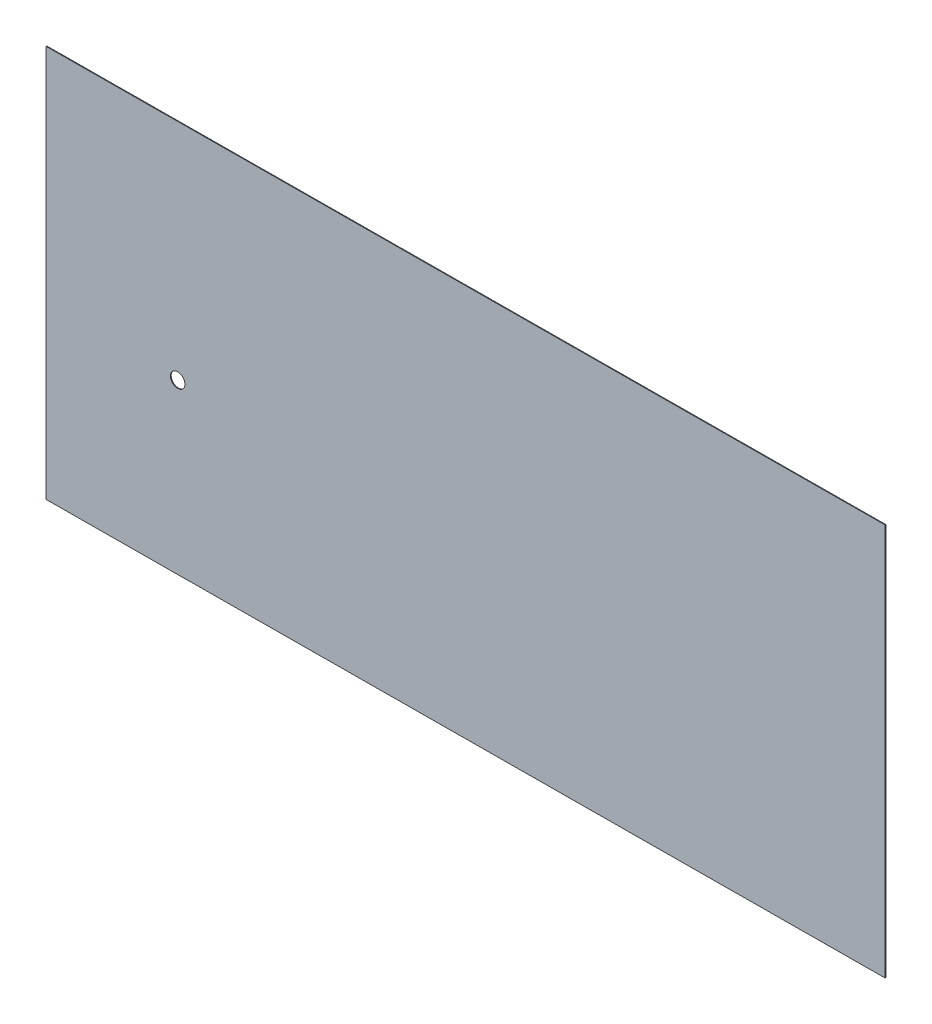
ISO-10303-21;
HEADER;
FILE_DESCRIPTION(('STEP AP214'),'2;1');
FILE_NAME('part.step','',(''),(''),'','','');
FILE_SCHEMA(('AUTOMOTIVE_DESIGN { 1 0 10303 214 1 1 1 1 }'));
ENDSEC;
DATA;
#1=APPLICATION_CONTEXT('core data for automotive mechanical design processes');
#2=APPLICATION_PROTOCOL_DEFINITION('international standard','automotive_design',2000,#1);
#3=PRODUCT_CONTEXT('',#1,'mechanical');
#4=PRODUCT('Part','Part','',(#3));
#5=PRODUCT_RELATED_PRODUCT_CATEGORY('part','',(#4));
#6=PRODUCT_DEFINITION_FORMATION('','',#4);
#7=PRODUCT_DEFINITION_CONTEXT('part definition',#1,'design');
#8=PRODUCT_DEFINITION('design','',#6,#7);
#9=PRODUCT_DEFINITION_SHAPE('','',#8);
#10=(LENGTH_UNIT() NAMED_UNIT(*) SI_UNIT(.MILLI.,.METRE.));
#11=(NAMED_UNIT(*) PLANE_ANGLE_UNIT() SI_UNIT($,.RADIAN.));
#12=(NAMED_UNIT(*) SI_UNIT($,.STERADIAN.) SOLID_ANGLE_UNIT());
#13=UNCERTAINTY_MEASURE_WITH_UNIT(LENGTH_MEASURE(1.E-05),#10,'distance_accuracy_value','');
#14=(GEOMETRIC_REPRESENTATION_CONTEXT(3) GLOBAL_UNCERTAINTY_ASSIGNED_CONTEXT((#13)) GLOBAL_UNIT_ASSIGNED_CONTEXT((#10,
#11,#12)) REPRESENTATION_CONTEXT('',''));
#15=CARTESIAN_POINT('',(0.,0.,0.));
#16=DIRECTION('',(0.,0.,1.));
#17=DIRECTION('',(1.,0.,0.));
#18=AXIS2_PLACEMENT_3D('',#15,#16,#17);
#19=CARTESIAN_POINT('',(-4.99393203883525,546.5,-822.984848367691));
#20=DIRECTION('',(0.999981589754181,0.,-0.00606796116504866));
#21=DIRECTION('',(0.,1.,0.));
#22=AXIS2_PLACEMENT_3D('',#19,#20,#21);
#23=PLANE('',#22);
#24=DIRECTION('',(0.00606796116504867,0.,0.999981589754181));
#25=VECTOR('',#24,1.);
#26=CARTESIAN_POINT('',(-4.99393203883525,1093.,-822.984848367691));
#27=LINE('',#26,#25);
#28=CARTESIAN_POINT('',(-5.000000000001,1093.,-823.984829957446));
#29=VERTEX_POINT('',#28);
#30=CARTESIAN_POINT('',(-4.9878640776706,1093.,-821.984866777937));
#31=VERTEX_POINT('',#30);
#32=EDGE_CURVE('E11',#29,#31,#27,.T.);
#33=ORIENTED_EDGE('',*,*,#32,.F.);
#34=DIRECTION('',(0.,1.,0.));
#35=VECTOR('',#34,1.);
#36=CARTESIAN_POINT('',(-5.000000000001,546.5,-823.984829957446));
#37=LINE('',#36,#35);
#38=CARTESIAN_POINT('',(-5.000000000001,0.,-823.984829957446));
#39=VERTEX_POINT('',#38);
#40=EDGE_CURVE('E79',#29,#39,#37,.F.);
#41=ORIENTED_EDGE('',*,*,#40,.T.);
#42=DIRECTION('',(0.00606796116504867,0.,0.999981589754181));
#43=VECTOR('',#42,1.);
#44=CARTESIAN_POINT('',(-4.99393203883525,0.,-822.984848367691));
#45=LINE('',#44,#43);
#46=CARTESIAN_POINT('',(-4.9878640776706,0.,-821.984866777937));
#47=VERTEX_POINT('',#46);
#48=EDGE_CURVE('E51',#39,#47,#45,.T.);
#49=ORIENTED_EDGE('',*,*,#48,.T.);
#50=DIRECTION('',(0.,1.,0.));
#51=VECTOR('',#50,1.);
#52=CARTESIAN_POINT('',(-4.9878640776706,546.5,-821.984866777937));
#53=LINE('',#52,#51);
#54=EDGE_CURVE('E81',#31,#47,#53,.F.);
#55=ORIENTED_EDGE('',*,*,#54,.F.);
#56=EDGE_LOOP('',(#33,#41,#49,#55));
#57=FACE_BOUND('',#56,.T.);
#58=ADVANCED_FACE('F40',(#57),#23,.F.);
#59=CARTESIAN_POINT('',(1156.30423815181,0.,-830.031690299543));
#60=DIRECTION('',(0.,-1.,0.));
#61=DIRECTION('',(0.999981589754181,0.,-0.00606796116504866));
#62=AXIS2_PLACEMENT_3D('',#59,#60,#61);
#63=PLANE('',#62);
#64=ORIENTED_EDGE('',*,*,#48,.F.);
#65=DIRECTION('',(0.999981589754181,0.,-0.00606796116504866));
#66=VECTOR('',#65,1.);
#67=CARTESIAN_POINT('',(1156.29817019064,0.,-831.031671889297));
#68=LINE('',#67,#66);
#69=CARTESIAN_POINT('',(2317.59634038129,0.,-838.078513821148));
#70=VERTEX_POINT('',#69);
#71=EDGE_CURVE('E93',#39,#70,#68,.T.);
#72=ORIENTED_EDGE('',*,*,#71,.T.);
#73=DIRECTION('',(0.00606796116504867,0.,0.999981589754181));
#74=VECTOR('',#73,1.);
#75=CARTESIAN_POINT('',(2317.60240834245,0.,-837.078532231394));
#76=LINE('',#75,#74);
#77=CARTESIAN_POINT('',(2317.60847630362,0.,-836.078550641639));
#78=VERTEX_POINT('',#77);
#79=EDGE_CURVE('E108',#70,#78,#76,.T.);
#80=ORIENTED_EDGE('',*,*,#79,.T.);
#81=DIRECTION('',(0.999981589754181,0.,-0.00606796116504866));
#82=VECTOR('',#81,1.);
#83=CARTESIAN_POINT('',(1156.31030611297,0.,-829.031708709788));
#84=LINE('',#83,#82);
#85=EDGE_CURVE('E102',#47,#78,#84,.T.);
#86=ORIENTED_EDGE('',*,*,#85,.F.);
#87=EDGE_LOOP('',(#64,#72,#80,#86));
#88=FACE_BOUND('',#87,.T.);
#89=ADVANCED_FACE('F120',(#88),#63,.T.);
#90=CARTESIAN_POINT('',(2317.60240834245,546.5,-837.078532231394));
#91=DIRECTION('',(0.999981589754181,0.,-0.00606796116504866));
#92=DIRECTION('',(0.,1.,0.));
#93=AXIS2_PLACEMENT_3D('',#90,#91,#92);
#94=PLANE('',#93);
#95=ORIENTED_EDGE('',*,*,#79,.F.);
#96=DIRECTION('',(0.,1.,0.));
#97=VECTOR('',#96,1.);
#98=CARTESIAN_POINT('',(2317.59634038129,546.5,-838.078513821148));
#99=LINE('',#98,#97);
#100=CARTESIAN_POINT('',(2317.59634038129,1093.,-838.078513821148));
#101=VERTEX_POINT('',#100);
#102=EDGE_CURVE('E98',#70,#101,#99,.T.);
#103=ORIENTED_EDGE('',*,*,#102,.T.);
#104=DIRECTION('',(0.00606796116504867,0.,0.999981589754181));
#105=VECTOR('',#104,1.);
#106=CARTESIAN_POINT('',(2317.60240834245,1093.,-837.078532231394));
#107=LINE('',#106,#105);
#108=CARTESIAN_POINT('',(2317.60847630362,1093.,-836.078550641639));
#109=VERTEX_POINT('',#108);
#110=EDGE_CURVE('E44',#101,#109,#107,.T.);
#111=ORIENTED_EDGE('',*,*,#110,.T.);
#112=DIRECTION('',(0.,1.,0.));
#113=VECTOR('',#112,1.);
#114=CARTESIAN_POINT('',(2317.60847630362,546.5,-836.078550641639));
#115=LINE('',#114,#113);
#116=EDGE_CURVE('E121',#78,#109,#115,.T.);
#117=ORIENTED_EDGE('',*,*,#116,.F.);
#118=EDGE_LOOP('',(#95,#103,#111,#117));
#119=FACE_BOUND('',#118,.T.);
#120=ADVANCED_FACE('F176',(#119),#94,.T.);
#121=CARTESIAN_POINT('',(1156.30423815181,1093.,-830.031690299543));
#122=DIRECTION('',(0.,-1.,0.));
#123=DIRECTION('',(0.999981589754181,0.,-0.00606796116504866));
#124=AXIS2_PLACEMENT_3D('',#121,#122,#123);
#125=PLANE('',#124);
#126=DIRECTION('',(0.999981589754181,0.,-0.00606796116504866));
#127=VECTOR('',#126,1.);
#128=CARTESIAN_POINT('',(1156.29817019064,1093.,-831.031671889297));
#129=LINE('',#128,#127);
#130=EDGE_CURVE('E91',#101,#29,#129,.F.);
#131=ORIENTED_EDGE('',*,*,#130,.T.);
#132=ORIENTED_EDGE('',*,*,#32,.T.);
#133=DIRECTION('',(0.999981589754181,0.,-0.00606796116504866));
#134=VECTOR('',#133,1.);
#135=CARTESIAN_POINT('',(1156.31030611297,1093.,-829.031708709788));
#136=LINE('',#135,#134);
#137=EDGE_CURVE('E119',#109,#31,#136,.F.);
#138=ORIENTED_EDGE('',*,*,#137,.F.);
#139=ORIENTED_EDGE('',*,*,#110,.F.);
#140=EDGE_LOOP('',(#131,#132,#138,#139));
#141=FACE_BOUND('',#140,.T.);
#142=ADVANCED_FACE('F42',(#141),#125,.F.);
#143=CARTESIAN_POINT('',(1156.31030611297,546.5,-829.031708709788));
#144=DIRECTION('',(0.00606796116504867,0.,0.999981589754181));
#145=DIRECTION('',(0.999981589754181,0.,-0.00606796116504866));
#146=AXIS2_PLACEMENT_3D('',#143,#144,#145);
#147=PLANE('',#146);
#148=CARTESIAN_POINT('',(339.074950675495,469.0000000268,-824.072665013075));
#149=CARTESIAN_POINT('',(339.074952175354,468.328584783968,-824.072665022177));
#150=CARTESIAN_POINT('',(339.109270419941,467.657108868376,-824.072873267786));
#151=CARTESIAN_POINT('',(339.245169879086,466.321042548984,-824.073697915608));
#152=CARTESIAN_POINT('',(339.346748960097,465.656451927458,-824.074314304875));
#153=CARTESIAN_POINT('',(339.593612302406,464.449151278049,-824.075812289628));
#154=CARTESIAN_POINT('',(339.728953983658,463.904381306161,-824.076633552813));
#155=CARTESIAN_POINT('',(340.044908442255,462.827879149409,-824.078550787494));
#156=CARTESIAN_POINT('',(340.225531299392,462.296149896439,-824.079646820155));
#157=CARTESIAN_POINT('',(340.529891044368,461.51132230611,-824.08149369727));
#158=CARTESIAN_POINT('',(340.637000907703,461.251665596134,-824.082143647727));
#159=CARTESIAN_POINT('',(340.86218373962,460.737150092206,-824.083510073562));
#160=CARTESIAN_POINT('',(340.980256731423,460.482291308418,-824.084226549081));
#161=CARTESIAN_POINT('',(341.350458081397,459.725569546191,-824.086472957853));
#162=CARTESIAN_POINT('',(341.618616336485,459.231438855324,-824.088100161688));
#163=CARTESIAN_POINT('',(342.195074381275,458.267799266706,-824.091598151116));
#164=CARTESIAN_POINT('',(342.503342534786,457.798271368953,-824.093468744738));
#165=CARTESIAN_POINT('',(343.158007303258,456.886586975724,-824.097441298265));
#166=CARTESIAN_POINT('',(343.504402925405,456.444429768001,-824.099543252146));
#167=CARTESIAN_POINT('',(344.23306707273,455.590874551994,-824.103964839296));
#168=CARTESIAN_POINT('',(344.615328194218,455.179470226782,-824.106284427641));
#169=CARTESIAN_POINT('',(345.413449958345,454.390659581939,-824.111127488672));
#170=CARTESIAN_POINT('',(345.829310711533,454.013253374179,-824.11365096203));
#171=CARTESIAN_POINT('',(346.692037001546,453.293955871417,-824.118886048034));
#172=CARTESIAN_POINT('',(347.138960933633,452.952134658138,-824.121598015025));
#173=CARTESIAN_POINT('',(348.059793722772,452.307013749988,-824.1271856955));
#174=CARTESIAN_POINT('',(348.533703530012,452.003715412744,-824.130061414749));
#175=CARTESIAN_POINT('',(349.505342994726,451.437768861924,-824.135957393833));
#176=CARTESIAN_POINT('',(350.003074469016,451.175123755352,-824.138977664694));
#177=CARTESIAN_POINT('',(350.764818901969,450.813411875849,-824.143599985429));
#178=CARTESIAN_POINT('',(351.021279558414,450.698209217535,-824.145156207383));
#179=CARTESIAN_POINT('',(351.538873406771,450.478828487614,-824.148297004577));
#180=CARTESIAN_POINT('',(351.800006590888,450.374650397616,-824.149881579769));
#181=CARTESIAN_POINT('',(352.590833119863,450.078427140048,-824.154680372782));
#182=CARTESIAN_POINT('',(353.126924769694,449.903181193952,-824.157933415984));
#183=CARTESIAN_POINT('',(354.21189057084,449.598290184663,-824.164517067537));
#184=CARTESIAN_POINT('',(354.760765850328,449.468649162546,-824.167847682735));
#185=CARTESIAN_POINT('',(355.867441774931,449.255716661479,-824.1745630729));
#186=CARTESIAN_POINT('',(356.425242535724,449.172425783747,-824.177947848568));
#187=CARTESIAN_POINT('',(357.54589935732,449.052978130169,-824.184748075835));
#188=CARTESIAN_POINT('',(358.108754956869,449.016817096848,-824.188163524634));
#189=CARTESIAN_POINT('',(358.954231121696,448.998541146611,-824.19329393562));
#190=CARTESIAN_POINT('',(359.236562343049,448.998462945255,-824.195007142048));
#191=CARTESIAN_POINT('',(359.800971447485,449.010350512539,-824.198432017627));
#192=CARTESIAN_POINT('',(360.083049329275,449.022316342317,-824.200143686772));
#193=CARTESIAN_POINT('',(360.928159622313,449.07611148578,-824.205271877622));
#194=CARTESIAN_POINT('',(361.490153407282,449.135836677355,-824.208682096867));
#195=CARTESIAN_POINT('',(362.60705317246,449.302214176087,-824.215459526041));
#196=CARTESIAN_POINT('',(363.161959347974,449.408865187283,-824.218826737155));
#197=CARTESIAN_POINT('',(364.260873553531,449.668306810475,-824.225495028644));
#198=CARTESIAN_POINT('',(364.804882142169,449.821095051048,-824.228796112407));
#199=CARTESIAN_POINT('',(365.877594682711,450.17193830677,-824.235305410282));
#200=CARTESIAN_POINT('',(366.406311487938,450.369953982559,-824.238513702389));
#201=CARTESIAN_POINT('',(367.444915217162,450.810400686034,-824.244816025511));
#202=CARTESIAN_POINT('',(367.954801897487,451.052832288242,-824.247910055047));
#203=CARTESIAN_POINT('',(368.952320239554,451.579740142177,-824.253963069046));
#204=CARTESIAN_POINT('',(369.439953009069,451.86421429808,-824.25692206023));
#205=CARTESIAN_POINT('',(370.389667241782,452.47301412735,-824.262684995409));
#206=CARTESIAN_POINT('',(370.851748060552,452.797340805143,-824.265488935494));
#207=CARTESIAN_POINT('',(371.746367629377,453.483156167313,-824.270917552237));
#208=CARTESIAN_POINT('',(372.178953299703,453.844583423546,-824.273542513611));
#209=CARTESIAN_POINT('',(372.803609770618,454.413112882475,-824.277332974601));
#210=CARTESIAN_POINT('',(373.007807454583,454.607037906361,-824.27857206103));
#211=CARTESIAN_POINT('',(373.407732098095,455.00343441923,-824.280998832913));
#212=CARTESIAN_POINT('',(373.603459064168,455.205905901629,-824.282186518407));
#213=CARTESIAN_POINT('',(374.177444300262,455.825479544813,-824.285669502652));
#214=CARTESIAN_POINT('',(374.542616220354,456.254840469881,-824.287885392477));
#215=CARTESIAN_POINT('',(375.235603274204,457.142682538101,-824.292090488424));
#216=CARTESIAN_POINT('',(375.563415260795,457.601166129461,-824.294079675449));
#217=CARTESIAN_POINT('',(376.178940525812,458.543145122823,-824.297814727617));
#218=CARTESIAN_POINT('',(376.466723787482,459.02659479323,-824.299561017423));
#219=CARTESIAN_POINT('',(377.000654100661,460.015999684072,-824.302800945476));
#220=CARTESIAN_POINT('',(377.246805072431,460.521952779822,-824.304294607512));
#221=CARTESIAN_POINT('',(377.583000145425,461.295099422616,-824.306334663716));
#222=CARTESIAN_POINT('',(377.689570187765,461.555214884852,-824.3069813385));
#223=CARTESIAN_POINT('',(377.891539954353,462.079747459035,-824.308206905763));
#224=CARTESIAN_POINT('',(377.98693961477,462.344164595553,-824.308785797856));
#225=CARTESIAN_POINT('',(378.25625194264,463.143126324075,-824.310420004688));
#226=CARTESIAN_POINT('',(378.413311055489,463.683457490496,-824.311373050831));
#227=CARTESIAN_POINT('',(378.681368127529,464.774449967184,-824.312999640681));
#228=CARTESIAN_POINT('',(378.792437652468,465.325093823066,-824.313673618653));
#229=CARTESIAN_POINT('',(378.968135056628,466.433734533422,-824.314739763306));
#230=CARTESIAN_POINT('',(379.032765560813,466.991730970475,-824.315131945916));
#231=CARTESIAN_POINT('',(379.114734102223,468.111222716915,-824.315629336999));
#232=CARTESIAN_POINT('',(379.132070318143,468.672718160215,-824.315734534421));
#233=CARTESIAN_POINT('',(379.118809720978,469.795148377628,-824.31565406815));
#234=CARTESIAN_POINT('',(379.088212075773,470.356083141839,-824.315468399409));
#235=CARTESIAN_POINT('',(378.980024848169,471.473159084359,-824.314811911427));
#236=CARTESIAN_POINT('',(378.902454287958,472.02930211072,-824.314341207615));
#237=CARTESIAN_POINT('',(378.70111444451,473.133154837478,-824.313119462771));
#238=CARTESIAN_POINT('',(378.577344069219,473.680864338209,-824.312368415114));
#239=CARTESIAN_POINT('',(378.284339120088,474.764093713258,-824.310590439728));
#240=CARTESIAN_POINT('',(378.115102697336,475.299613090895,-824.309563500781));
#241=CARTESIAN_POINT('',(377.82781033987,476.090586390828,-824.307820189818));
#242=CARTESIAN_POINT('',(377.726463403566,476.352214537696,-824.307205209223));
#243=CARTESIAN_POINT('',(377.512706199904,476.870911505566,-824.305908114932));
#244=CARTESIAN_POINT('',(377.400295936653,477.12798032826,-824.305226001262));
#245=CARTESIAN_POINT('',(377.046565834361,477.89237554854,-824.303079541222));
#246=CARTESIAN_POINT('',(376.788969423898,478.392278150117,-824.30151642743));
#247=CARTESIAN_POINT('',(376.232794867,479.368703422376,-824.298141519685));
#248=CARTESIAN_POINT('',(375.934213216145,479.845224089063,-824.296329704467));
#249=CARTESIAN_POINT('',(375.298271341336,480.771656922457,-824.292470762823));
#250=CARTESIAN_POINT('',(374.960910467409,481.221568642984,-824.290423632453));
#251=CARTESIAN_POINT('',(374.249596612627,482.091512049361,-824.286107328142));
#252=CARTESIAN_POINT('',(373.875646950778,482.511546439456,-824.283838174341));
#253=CARTESIAN_POINT('',(373.288560056597,483.11705250429,-824.28027568828));
#254=CARTESIAN_POINT('',(373.088205942675,483.315056143921,-824.279059924915));
#255=CARTESIAN_POINT('',(372.679248696577,483.702352719295,-824.276578342541));
#256=CARTESIAN_POINT('',(372.470645513868,483.891645601659,-824.275312523225));
#257=CARTESIAN_POINT('',(371.833097763102,484.446056389193,-824.271443837009));
#258=CARTESIAN_POINT('',(371.392357640631,484.797765506333,-824.268769393825));
#259=CARTESIAN_POINT('',(370.483057289835,485.462965174763,-824.263251693027));
#260=CARTESIAN_POINT('',(370.014497566065,485.776456418881,-824.260408438474));
#261=CARTESIAN_POINT('',(369.052715495149,486.363137401864,-824.254572274774));
#262=CARTESIAN_POINT('',(368.559494522956,486.636329384209,-824.251579373969));
#263=CARTESIAN_POINT('',(367.803712365125,487.014210949669,-824.246993232754));
#264=CARTESIAN_POINT('',(367.549031736174,487.134891523151,-824.245447812136));
#265=CARTESIAN_POINT('',(367.034769095232,487.365313273446,-824.242327228951));
#266=CARTESIAN_POINT('',(366.77518711266,487.47505451589,-824.240752066563));
#267=CARTESIAN_POINT('',(365.989786958281,487.787511641157,-824.235986201186));
#268=CARTESIAN_POINT('',(365.457211859471,487.973512303251,-824.232754496673));
#269=CARTESIAN_POINT('',(364.37841883179,488.300056202502,-824.226208301959));
#270=CARTESIAN_POINT('',(363.83220155359,488.440601603224,-824.222893815706));
#271=CARTESIAN_POINT('',(362.729916581183,488.675521207358,-824.21620507016));
#272=CARTESIAN_POINT('',(362.173848689398,488.769894483583,-824.212830809666));
#273=CARTESIAN_POINT('',(361.055857900588,488.911663771668,-824.206046760081));
#274=CARTESIAN_POINT('',(360.493936918798,488.959074690932,-824.202636982611));
#275=CARTESIAN_POINT('',(359.649707434912,488.99439437731,-824.197514136575));
#276=CARTESIAN_POINT('',(359.368048937001,489.000200462188,-824.195805012283));
#277=CARTESIAN_POINT('',(358.804740816556,488.999788934876,-824.192386817554));
#278=CARTESIAN_POINT('',(358.523091194024,488.993571320737,-824.190677747118));
#279=CARTESIAN_POINT('',(357.678961839336,488.95702484658,-824.185555508674));
#280=CARTESIAN_POINT('',(357.117157180109,488.908808330006,-824.182146437057));
#281=CARTESIAN_POINT('',(355.999601031846,488.765468324197,-824.175365024902));
#282=CARTESIAN_POINT('',(355.443850039914,488.670341012053,-824.17199268738));
#283=CARTESIAN_POINT('',(354.342483501728,488.433997701838,-824.165309514959));
#284=CARTESIAN_POINT('',(353.796863404374,488.292802955359,-824.161998652444));
#285=CARTESIAN_POINT('',(352.719444192978,487.965103035531,-824.155460794147));
#286=CARTESIAN_POINT('',(352.187643810326,487.77860203755,-824.152233790668));
#287=CARTESIAN_POINT('',(351.141853696899,487.360966134576,-824.145887860042));
#288=CARTESIAN_POINT('',(350.627864217071,487.129830601006,-824.142768934419));
#289=CARTESIAN_POINT('',(349.621177617009,486.625021319542,-824.136660286763));
#290=CARTESIAN_POINT('',(349.128482290741,486.351343996527,-824.133670575616));
#291=CARTESIAN_POINT('',(348.167979228309,485.76388990398,-824.127842173032));
#292=CARTESIAN_POINT('',(347.700158982433,485.4501335656,-824.125003405685));
#293=CARTESIAN_POINT('',(346.792389726971,484.784529605132,-824.119494995685));
#294=CARTESIAN_POINT('',(346.352439020317,484.432684305949,-824.116825342733));
#295=CARTESIAN_POINT('',(345.716045241389,483.878128476373,-824.112963658903));
#296=CARTESIAN_POINT('',(345.507816558485,483.688791794085,-824.111700112079));
#297=CARTESIAN_POINT('',(345.099604715721,483.301429321405,-824.109223052867));
#298=CARTESIAN_POINT('',(344.899621511144,483.103403578148,-824.108009540207));
#299=CARTESIAN_POINT('',(344.312615221318,482.496816821291,-824.104447543259));
#300=CARTESIAN_POINT('',(343.938451109496,482.075672792408,-824.10217708816));
#301=CARTESIAN_POINT('',(343.227176974005,481.203834421196,-824.097861024868));
#302=CARTESIAN_POINT('',(342.890037958911,480.753163646851,-824.095815240754));
#303=CARTESIAN_POINT('',(342.254626174613,479.825198867051,-824.091959515738));
#304=CARTESIAN_POINT('',(341.956353917889,479.347904510669,-824.090149577946));
#305=CARTESIAN_POINT('',(341.400761819851,478.369692677941,-824.086778204604));
#306=CARTESIAN_POINT('',(341.143459195437,477.868765384219,-824.085216873527));
#307=CARTESIAN_POINT('',(340.790131946014,477.102492350908,-824.083072858027));
#308=CARTESIAN_POINT('',(340.677785559052,476.844564393553,-824.082391131963));
#309=CARTESIAN_POINT('',(340.464222065708,476.324140835307,-824.081095213121));
#310=CARTESIAN_POINT('',(340.363005029024,476.061645205822,-824.080481020765));
#311=CARTESIAN_POINT('',(340.070864330367,475.253304268342,-824.078708289715));
#312=CARTESIAN_POINT('',(339.898011162659,474.700806956101,-824.077659404096));
#313=CARTESIAN_POINT('',(339.600619008273,473.582950371683,-824.07585480683));
#314=CARTESIAN_POINT('',(339.476088501504,473.017588860443,-824.075099146639));
#315=CARTESIAN_POINT('',(339.276312491995,471.878922220276,-824.073886891253));
#316=CARTESIAN_POINT('',(339.201005616047,471.305627896899,-824.073429923642));
#317=CARTESIAN_POINT('',(339.100333750341,470.154902890722,-824.072819039424));
#318=CARTESIAN_POINT('',(339.07494938549,469.577473899959,-824.072665005248));
#319=CARTESIAN_POINT('',(339.074950675495,469.0000000268,-824.072665013075));
#320=B_SPLINE_CURVE_WITH_KNOTS('',3,(#148,#149,#150,#151,#152,#153,#154,#155,#156,#157,#158,
#159,#160,#161,#162,#163,#164,#165,#166,#167,#168,#169,#170,#171,#172,#173,#174,#175,#176,#177,
#178,#179,#180,#181,#182,#183,#184,#185,#186,#187,#188,#189,#190,#191,#192,#193,#194,#195,#196,
#197,#198,#199,#200,#201,#202,#203,#204,#205,#206,#207,#208,#209,#210,#211,#212,#213,#214,#215,
#216,#217,#218,#219,#220,#221,#222,#223,#224,#225,#226,#227,#228,#229,#230,#231,#232,#233,#234,
#235,#236,#237,#238,#239,#240,#241,#242,#243,#244,#245,#246,#247,#248,#249,#250,#251,#252,#253,
#254,#255,#256,#257,#258,#259,#260,#261,#262,#263,#264,#265,#266,#267,#268,#269,#270,#271,#272,
#273,#274,#275,#276,#277,#278,#279,#280,#281,#282,#283,#284,#285,#286,#287,#288,#289,#290,#291,
#292,#293,#294,#295,#296,#297,#298,#299,#300,#301,#302,#303,#304,#305,#306,#307,#308,#309,#310,
#311,#312,#313,#314,#315,#316,#317,#318,#319),.UNSPECIFIED.,.T.,.F.,(4,2,2,2,2,2,2,2,2,2,2,2,2,
2,2,2,2,2,2,2,2,2,2,2,2,2,2,2,2,2,2,2,2,2,2,2,2,2,2,2,2,2,2,2,2,2,2,2,2,2,2,2,2,2,2,2,2,2,2,2,2,
2,2,2,2,2,2,2,2,2,2,2,2,2,2,2,2,2,2,2,2,2,2,2,2,4),(0.,2.01353392695023,4.02700398669606,
5.70914538217014,7.39166156289532,8.23408621213205,9.07651264581496,10.760973159179,
12.4441130387638,14.12720910087,15.8099584838925,17.4927134037393,19.1787220547761,
20.8647901078503,22.5509869584557,23.3942214977713,24.2374546303952,25.9273256999312,
27.6173464720607,29.3073891653202,30.9972791779925,31.8440640693849,32.6908532593373,
34.3841782275761,36.0774564338275,37.7706476215787,39.4623716226229,41.1541175077314,
42.8457790876292,44.5374833122072,46.2264303966459,47.0710434810042,47.9156559147642,
49.6044386485476,51.2933635388285,52.9792974908214,54.665072600086,55.5081520887305,
56.3512363947963,58.0371564276551,59.7204430006888,61.4036344185279,63.0868906552236,
64.7701761131278,66.4527803618988,68.1354243859701,69.8181368464537,70.659633679672,
71.5011302004871,73.1860722213508,74.8711584020827,76.5562728303415,78.2412345416283,
79.0860777051074,79.9309260448619,81.6203765225386,83.3097963686769,84.9991221284454,
85.844395323791,86.6896634474991,88.3798562670362,90.0699686254502,91.7601149217992,
93.4497245378081,94.294673018027,95.1396216351712,96.8290865863068,98.5186892400169,
100.207513554385,101.896182287845,103.584874804141,105.273709311314,106.961686308532,
108.649560420214,109.493664803831,110.33776460901,112.025629706165,113.712163602028,
115.398719733541,117.085982756098,117.929762222285,118.773546972376,120.507891631564,
122.242540504946,123.975022429757,125.706831839724),.UNSPECIFIED.);
#321=CARTESIAN_POINT('',(379.126827566034,469.,-824.315702721019));
#322=VERTEX_POINT('',#321);
#323=EDGE_CURVE('E95',#322,#322,#320,.F.);
#324=ORIENTED_EDGE('',*,*,#323,.T.);
#325=EDGE_LOOP('',(#324));
#326=FACE_BOUND('',#325,.T.);
#327=ORIENTED_EDGE('',*,*,#116,.T.);
#328=ORIENTED_EDGE('',*,*,#137,.T.);
#329=ORIENTED_EDGE('',*,*,#54,.T.);
#330=ORIENTED_EDGE('',*,*,#85,.T.);
#331=EDGE_LOOP('',(#327,#328,#329,#330));
#332=FACE_BOUND('',#331,.T.);
#333=ADVANCED_FACE('F118',(#326,#332),#147,.T.);
#334=CARTESIAN_POINT('',(1156.29817019064,546.5,-831.031671889297));
#335=DIRECTION('',(0.00606796116504867,0.,0.999981589754181));
#336=DIRECTION('',(0.999981589754181,0.,-0.00606796116504866));
#337=AXIS2_PLACEMENT_3D('',#334,#335,#336);
#338=PLANE('',#337);
#339=CARTESIAN_POINT('',(339.111430960637,469.000000024332,-826.072923199274));
#340=CARTESIAN_POINT('',(339.111432415972,469.671394371171,-826.072923208105));
#341=CARTESIAN_POINT('',(339.145653939678,470.342848187122,-826.073130866805));
#342=CARTESIAN_POINT('',(339.281199721399,471.678903886554,-826.073953368487));
#343=CARTESIAN_POINT('',(339.382521656179,472.343506006455,-826.074568197371));
#344=CARTESIAN_POINT('',(339.62899092243,473.551834998791,-826.076063790842));
#345=CARTESIAN_POINT('',(339.764294214453,474.097596151142,-826.076884821079));
#346=CARTESIAN_POINT('',(340.080255350267,475.176081349034,-826.078802096278));
#347=CARTESIAN_POINT('',(340.260923331118,475.708802451444,-826.079898402753));
#348=CARTESIAN_POINT('',(340.565421845941,476.495110421861,-826.081746121932));
#349=CARTESIAN_POINT('',(340.672590127967,476.755260208834,-826.082396426878));
#350=CARTESIAN_POINT('',(340.89791136495,477.270758639712,-826.083763692566));
#351=CARTESIAN_POINT('',(341.016064345023,477.526107272637,-826.08448065346));
#352=CARTESIAN_POINT('',(341.386543350173,478.284289838733,-826.086728747063));
#353=CARTESIAN_POINT('',(341.654936957909,478.779382910244,-826.088357379036));
#354=CARTESIAN_POINT('',(342.231946568775,479.744821204885,-826.091858715407));
#355=CARTESIAN_POINT('',(342.540524694286,480.215189154929,-826.093731189961));
#356=CARTESIAN_POINT('',(343.195942239001,481.128475078535,-826.097708311389));
#357=CARTESIAN_POINT('',(343.542780583001,481.571393822942,-826.099812951738));
#358=CARTESIAN_POINT('',(344.2724816247,482.426344493428,-826.10424083084));
#359=CARTESIAN_POINT('',(344.655336615651,482.838382993432,-826.106564022827));
#360=CARTESIAN_POINT('',(345.454786098481,483.62831366243,-826.111415140553));
#361=CARTESIAN_POINT('',(345.87138075344,484.006205666357,-826.11394306728));
#362=CARTESIAN_POINT('',(346.734767341825,484.725523599301,-826.119182160022));
#363=CARTESIAN_POINT('',(347.181552439548,485.066957738212,-826.121893284557));
#364=CARTESIAN_POINT('',(348.102118669631,485.711248501386,-826.127479347531));
#365=CARTESIAN_POINT('',(348.575900640201,486.014103926895,-826.130354291058));
#366=CARTESIAN_POINT('',(349.54730104495,486.57906909734,-826.136248819509));
#367=CARTESIAN_POINT('',(350.044921097085,486.841176071425,-826.139268414252));
#368=CARTESIAN_POINT('',(350.806512053352,487.201976669059,-826.143889803679));
#369=CARTESIAN_POINT('',(351.062924008856,487.316858258698,-826.145445730113));
#370=CARTESIAN_POINT('',(351.580422693765,487.535559309964,-826.148585949848));
#371=CARTESIAN_POINT('',(351.84150941579,487.639378789049,-826.150170243105));
#372=CARTESIAN_POINT('',(352.63094037469,487.934011773649,-826.154960567697));
#373=CARTESIAN_POINT('',(353.165637259132,488.108085903585,-826.15820514736));
#374=CARTESIAN_POINT('',(354.247731722868,488.410706683448,-826.164771375429));
#375=CARTESIAN_POINT('',(354.795130410664,488.539249343751,-826.168093030561));
#376=CARTESIAN_POINT('',(355.898772743475,488.750044542416,-826.17479001267));
#377=CARTESIAN_POINT('',(356.455016439535,488.832296813538,-826.178165339956));
#378=CARTESIAN_POINT('',(357.572482726411,488.949711572872,-826.184946206826));
#379=CARTESIAN_POINT('',(358.133704848277,488.984878449933,-826.188351743563));
#380=CARTESIAN_POINT('',(358.976259789769,489.001673401992,-826.193464428353));
#381=CARTESIAN_POINT('',(359.25733369047,489.001272490971,-826.195170005267));
#382=CARTESIAN_POINT('',(359.819208711556,488.988477038839,-826.198579503844));
#383=CARTESIAN_POINT('',(360.100009830508,488.976082435056,-826.200283425499));
#384=CARTESIAN_POINT('',(360.941264485712,488.921078092149,-826.205388220057));
#385=CARTESIAN_POINT('',(361.500653035838,488.860649434086,-826.208782630547));
#386=CARTESIAN_POINT('',(362.612290484417,488.693084024223,-826.215528127601));
#387=CARTESIAN_POINT('',(363.164539600696,488.585948700935,-826.218879215487));
#388=CARTESIAN_POINT('',(364.258109342589,488.325769347073,-826.22551507638));
#389=CARTESIAN_POINT('',(364.799430543237,488.172727738874,-826.228799852876));
#390=CARTESIAN_POINT('',(365.866687485933,487.821641592119,-826.235276045786));
#391=CARTESIAN_POINT('',(366.392638176783,487.623642541194,-826.238467552909));
#392=CARTESIAN_POINT('',(367.425733904799,487.183493424591,-826.244736453079));
#393=CARTESIAN_POINT('',(367.93287870077,486.941342792882,-826.247813844661));
#394=CARTESIAN_POINT('',(368.924977880129,486.415279117986,-826.253833974786));
#395=CARTESIAN_POINT('',(369.409933324179,486.131368073704,-826.256776719763));
#396=CARTESIAN_POINT('',(370.354401515032,485.523990406719,-826.262507821578));
#397=CARTESIAN_POINT('',(370.813913571943,485.200522712205,-826.265296174229));
#398=CARTESIAN_POINT('',(371.704104449138,484.516311246293,-826.270697917348));
#399=CARTESIAN_POINT('',(372.134794836822,484.15558257901,-826.273311378009));
#400=CARTESIAN_POINT('',(372.756709086645,483.588270606827,-826.277085199002));
#401=CARTESIAN_POINT('',(372.960009306917,483.394779834138,-826.278318839556));
#402=CARTESIAN_POINT('',(373.358177177566,482.99930788291,-826.280734951213));
#403=CARTESIAN_POINT('',(373.553044836378,482.797326712863,-826.281917422369));
#404=CARTESIAN_POINT('',(374.124517572585,482.179300261355,-826.285385160581));
#405=CARTESIAN_POINT('',(374.488096978539,481.751076575251,-826.287591386914));
#406=CARTESIAN_POINT('',(375.178109278699,480.865716795864,-826.291778431839));
#407=CARTESIAN_POINT('',(375.504538993839,480.408578233404,-826.29375923114));
#408=CARTESIAN_POINT('',(376.118263172534,479.468411715941,-826.297483354185));
#409=CARTESIAN_POINT('',(376.405537635026,478.985370703832,-826.29922655656));
#410=CARTESIAN_POINT('',(376.938573660597,477.996867116287,-826.302461058011));
#411=CARTESIAN_POINT('',(377.184339006665,477.49140658939,-826.303952380042));
#412=CARTESIAN_POINT('',(377.520083257095,476.719054634525,-826.305989700622));
#413=CARTESIAN_POINT('',(377.626524747418,476.459212042967,-826.306635595343));
#414=CARTESIAN_POINT('',(377.828276416188,475.935240290612,-826.307859839173));
#415=CARTESIAN_POINT('',(377.9235865357,475.671111107128,-826.308438187924));
#416=CARTESIAN_POINT('',(378.192692248545,474.873033026936,-826.310071141002));
#417=CARTESIAN_POINT('',(378.349696221571,474.33331749026,-826.311023852553));
#418=CARTESIAN_POINT('',(378.618133595866,473.242337197237,-826.312652750103));
#419=CARTESIAN_POINT('',(378.729533991634,472.691064378593,-826.313328735824));
#420=CARTESIAN_POINT('',(378.905882863996,471.581144202891,-826.314398833634));
#421=CARTESIAN_POINT('',(378.970833787616,471.022497235894,-826.314792960572));
#422=CARTESIAN_POINT('',(379.053452965461,469.901678619033,-826.315294299764));
#423=CARTESIAN_POINT('',(379.071119103923,469.339506812577,-826.31540149918));
#424=CARTESIAN_POINT('',(379.058530356608,468.215694606802,-826.315325109744));
#425=CARTESIAN_POINT('',(379.028274668097,467.654054216542,-826.315141516021));
#426=CARTESIAN_POINT('',(378.920697840084,466.534883909642,-826.314488731988));
#427=CARTESIAN_POINT('',(378.843341152643,465.977357419805,-826.314019325971));
#428=CARTESIAN_POINT('',(378.642296808713,464.870728015562,-826.31279937424));
#429=CARTESIAN_POINT('',(378.518608036505,464.32162530434,-826.312048821756));
#430=CARTESIAN_POINT('',(378.22562153977,463.235615114568,-826.310270958341));
#431=CARTESIAN_POINT('',(378.056321933616,462.698708140132,-826.309243635992));
#432=CARTESIAN_POINT('',(377.768818522318,461.905673151599,-826.307499044339));
#433=CARTESIAN_POINT('',(377.667381776364,461.643360859823,-826.306883518772));
#434=CARTESIAN_POINT('',(377.453406967899,461.123303943299,-826.30558510404));
#435=CARTESIAN_POINT('',(377.340868908462,460.865559317287,-826.304902214894));
#436=CARTESIAN_POINT('',(376.986816859009,460.099408855869,-826.302753801254));
#437=CARTESIAN_POINT('',(376.728990593945,459.598432459249,-826.301189292688));
#438=CARTESIAN_POINT('',(376.172221625662,458.619910742526,-826.297810778011));
#439=CARTESIAN_POINT('',(375.873275456785,458.142367402009,-826.295996750871));
#440=CARTESIAN_POINT('',(375.236450334869,457.21397789726,-826.29213244962));
#441=CARTESIAN_POINT('',(374.898570905634,456.76313205967,-826.290082172618));
#442=CARTESIAN_POINT('',(374.186048697633,455.891450320346,-826.285758535932));
#443=CARTESIAN_POINT('',(373.811409320333,455.470611648205,-826.283485196887));
#444=CARTESIAN_POINT('',(373.223507499311,454.864395642257,-826.279917765791));
#445=CARTESIAN_POINT('',(373.023108946966,454.666403899723,-826.27870173277));
#446=CARTESIAN_POINT('',(372.614055348619,454.279141862159,-826.276219565724));
#447=CARTESIAN_POINT('',(372.405400251611,454.089871621023,-826.274953431388));
#448=CARTESIAN_POINT('',(371.76768075787,453.535551425129,-826.271083703023));
#449=CARTESIAN_POINT('',(371.326805091766,453.183933230752,-826.26840843735));
#450=CARTESIAN_POINT('',(370.417187165994,452.519014799735,-826.262888809484));
#451=CARTESIAN_POINT('',(369.948445628532,452.205713570669,-826.260044451673));
#452=CARTESIAN_POINT('',(368.986247247567,451.619554196641,-826.254205761773));
#453=CARTESIAN_POINT('',(368.492791910456,451.346693590687,-826.251211438824));
#454=CARTESIAN_POINT('',(367.737175199457,450.969724482868,-826.246626301553));
#455=CARTESIAN_POINT('',(367.482922645978,450.849531355049,-826.245083478528));
#456=CARTESIAN_POINT('',(366.969525978779,450.620090849681,-826.241968150135));
#457=CARTESIAN_POINT('',(366.710381895029,450.510843405094,-826.240395644949));
#458=CARTESIAN_POINT('',(365.926315647088,450.199864509217,-826.235637873814));
#459=CARTESIAN_POINT('',(365.39465773979,450.014845717725,-826.232411734885));
#460=CARTESIAN_POINT('',(364.317762161853,449.690269036558,-826.225877054035));
#461=CARTESIAN_POINT('',(363.7725252746,449.550708530856,-826.222568516866));
#462=CARTESIAN_POINT('',(362.67226386694,449.317776978639,-826.215892050457));
#463=CARTESIAN_POINT('',(362.117239186889,449.224406686231,-826.212524120249));
#464=CARTESIAN_POINT('',(361.002499051709,449.084815118321,-826.205759795866));
#465=CARTESIAN_POINT('',(360.442797166736,449.038486893467,-826.202363484037));
#466=CARTESIAN_POINT('',(359.601958494666,449.004692556594,-826.197261213695));
#467=CARTESIAN_POINT('',(359.321440775906,448.999378508364,-826.195559011734));
#468=CARTESIAN_POINT('',(358.76043443477,449.000737607027,-826.19215478437));
#469=CARTESIAN_POINT('',(358.479945812414,449.007410761771,-826.190452758967));
#470=CARTESIAN_POINT('',(357.63933188424,449.045260002443,-826.185351852387));
#471=CARTESIAN_POINT('',(357.079910103521,449.094259974469,-826.181957240252));
#472=CARTESIAN_POINT('',(355.967180505927,449.238986315587,-826.175205115958));
#473=CARTESIAN_POINT('',(355.413873194502,449.334716518488,-826.171847606867));
#474=CARTESIAN_POINT('',(354.317851842176,449.571981722316,-826.165196869423));
#475=CARTESIAN_POINT('',(353.775125755286,449.713460969046,-826.161903567974));
#476=CARTESIAN_POINT('',(352.703499288073,450.04145781636,-826.155400860472));
#477=CARTESIAN_POINT('',(352.174597612721,450.227971181403,-826.152191446559));
#478=CARTESIAN_POINT('',(351.134580198688,450.64535160626,-826.145880545095));
#479=CARTESIAN_POINT('',(350.623464735334,450.876219352311,-826.142779059213));
#480=CARTESIAN_POINT('',(349.622461809771,451.380194337728,-826.136704900508));
#481=CARTESIAN_POINT('',(349.13257616673,451.653305187749,-826.133732238723));
#482=CARTESIAN_POINT('',(348.177147043104,452.239582892964,-826.12793462517));
#483=CARTESIAN_POINT('',(347.711613438613,452.552765824857,-826.12510973333));
#484=CARTESIAN_POINT('',(346.808310351947,453.216968234199,-826.119628424367));
#485=CARTESIAN_POINT('',(346.370539209277,453.567985445353,-826.116971997169));
#486=CARTESIAN_POINT('',(345.737295754028,454.121103229903,-826.113129429732));
#487=CARTESIAN_POINT('',(345.530096903904,454.309928403675,-826.111872132009));
#488=CARTESIAN_POINT('',(345.123898902441,454.696201212082,-826.109407292932));
#489=CARTESIAN_POINT('',(344.92489970497,454.893648798193,-826.108199751299));
#490=CARTESIAN_POINT('',(344.340772337244,455.498406579968,-826.104655223861));
#491=CARTESIAN_POINT('',(343.968430981524,455.918204640246,-826.102395829378));
#492=CARTESIAN_POINT('',(343.259790689568,456.788056919038,-826.098095748441));
#493=CARTESIAN_POINT('',(342.923542248297,457.238152128745,-826.096055368393));
#494=CARTESIAN_POINT('',(342.289789358294,458.164849337235,-826.092209709669));
#495=CARTESIAN_POINT('',(341.992285525243,458.641451757065,-826.090404434728));
#496=CARTESIAN_POINT('',(341.438060653524,459.618168800965,-826.087041357815));
#497=CARTESIAN_POINT('',(341.181357371198,460.118293539883,-826.085483663589));
#498=CARTESIAN_POINT('',(340.828766139574,460.883282717038,-826.083344114299));
#499=CARTESIAN_POINT('',(340.716637927782,461.140769370967,-826.082663712138));
#500=CARTESIAN_POINT('',(340.503454867292,461.660287238315,-826.08137010179));
#501=CARTESIAN_POINT('',(340.402400092494,461.922318482049,-826.080756894052));
#502=CARTESIAN_POINT('',(340.109849323378,462.731483954317,-826.078981674664));
#503=CARTESIAN_POINT('',(339.936532184714,463.285313160739,-826.077929973635));
#504=CARTESIAN_POINT('',(339.63836222858,464.405876766177,-826.07612065661));
#505=CARTESIAN_POINT('',(339.513518068772,464.972613451455,-826.07536309315));
#506=CARTESIAN_POINT('',(339.313252281078,466.114054739298,-826.074147865755));
#507=CARTESIAN_POINT('',(339.237769289716,466.688748538398,-826.073689829462));
#508=CARTESIAN_POINT('',(339.136867730545,467.842281295824,-826.073077551448));
#509=CARTESIAN_POINT('',(339.111429705835,468.421118555339,-826.07292319166));
#510=CARTESIAN_POINT('',(339.111430960637,469.000000024332,-826.072923199274));
#511=B_SPLINE_CURVE_WITH_KNOTS('',3,(#339,#340,#341,#342,#343,#344,#345,#346,#347,#348,#349,
#350,#351,#352,#353,#354,#355,#356,#357,#358,#359,#360,#361,#362,#363,#364,#365,#366,#367,#368,
#369,#370,#371,#372,#373,#374,#375,#376,#377,#378,#379,#380,#381,#382,#383,#384,#385,#386,#387,
#388,#389,#390,#391,#392,#393,#394,#395,#396,#397,#398,#399,#400,#401,#402,#403,#404,#405,#406,
#407,#408,#409,#410,#411,#412,#413,#414,#415,#416,#417,#418,#419,#420,#421,#422,#423,#424,#425,
#426,#427,#428,#429,#430,#431,#432,#433,#434,#435,#436,#437,#438,#439,#440,#441,#442,#443,#444,
#445,#446,#447,#448,#449,#450,#451,#452,#453,#454,#455,#456,#457,#458,#459,#460,#461,#462,#463,
#464,#465,#466,#467,#468,#469,#470,#471,#472,#473,#474,#475,#476,#477,#478,#479,#480,#481,#482,
#483,#484,#485,#486,#487,#488,#489,#490,#491,#492,#493,#494,#495,#496,#497,#498,#499,#500,#501,
#502,#503,#504,#505,#506,#507,#508,#509,#510),.UNSPECIFIED.,.T.,.F.,(4,2,2,2,2,2,2,2,2,2,2,2,2,
2,2,2,2,2,2,2,2,2,2,2,2,2,2,2,2,2,2,2,2,2,2,2,2,2,2,2,2,2,2,2,2,2,2,2,2,2,2,2,2,2,2,2,2,2,2,2,2,
2,2,2,2,2,2,2,2,2,2,2,2,2,2,2,2,2,2,2,2,2,2,2,2,4),(0.,2.0134727776223,4.02687584587381,
5.71187216667984,7.39724534744651,8.2411038841716,9.08496435036046,10.7722924618915,
12.4580414697102,14.1437431159618,15.8290848770422,17.5144347846965,19.1994043668502,
20.8844262931833,22.5695627491063,23.4122681885006,24.2549722978663,25.9397788991308,
27.6247330924397,29.3096970131175,30.994503866712,31.8375183419962,32.6805372224579,
34.3663246031991,36.0520604281771,37.7377073162157,39.4216562188609,41.1056267115204,
42.7895166253827,44.4734521753553,46.156707783933,46.9984737456864,47.8402388654453,
49.5233457167732,51.2065964910146,52.8907038969595,54.5746577365868,55.4168350022612,
56.2590167266572,57.9431320781016,59.6284641590062,61.3137074476787,62.9990261415099,
64.6843730661987,66.3709935306681,68.0576546130649,69.7443852875511,70.5878925088195,
71.4313994965039,73.1195141932903,74.8077712546452,76.4960489674176,78.1841706078297,
79.0290830109438,79.874000634431,81.5635909285517,83.2531374522381,84.9425811172525,
85.7860675545241,86.6295488254283,88.3161713542247,90.0026968043395,91.6892497879865,
93.3719597782207,94.2134575724871,95.0549559179091,96.7375084647782,98.4201990736707,
100.10084667371,101.781336267248,103.461851862821,105.14251117694,106.823846889017,
108.505081944013,109.345870738453,110.186654801842,111.867891800721,113.551451053623,
115.235037056222,116.919353758543,117.761659985322,118.603971832915,120.34253462776,
122.081407801114,123.818115159059,125.554147171806),.UNSPECIFIED.);
#512=CARTESIAN_POINT('',(379.066075436148,469.,-826.315370893836));
#513=VERTEX_POINT('',#512);
#514=EDGE_CURVE('E133',#513,#513,#511,.F.);
#515=ORIENTED_EDGE('',*,*,#514,.T.);
#516=EDGE_LOOP('',(#515));
#517=FACE_BOUND('',#516,.T.);
#518=ORIENTED_EDGE('',*,*,#102,.F.);
#519=ORIENTED_EDGE('',*,*,#71,.F.);
#520=ORIENTED_EDGE('',*,*,#40,.F.);
#521=ORIENTED_EDGE('',*,*,#130,.F.);
#522=EDGE_LOOP('',(#518,#519,#520,#521));
#523=FACE_BOUND('',#522,.T.);
#524=ADVANCED_FACE('F90',(#517,#523),#338,.F.);
#525=CARTESIAN_POINT('',(379.126827566034,469.,-824.315702721019));
#526=CARTESIAN_POINT('',(379.066075436148,469.,-826.315370893836));
#527=CARTESIAN_POINT('',(379.126827561751,466.380683791318,-824.315702720993));
#528=CARTESIAN_POINT('',(379.066075431709,466.38395845195,-826.31537089381));
#529=CARTESIAN_POINT('',(378.604560030491,463.761255761234,-824.31253356355));
#530=CARTESIAN_POINT('',(378.546546216478,463.767805222484,-826.312218352668));
#531=CARTESIAN_POINT('',(376.596249951002,458.922869367262,-824.300346991623));
#532=CARTESIAN_POINT('',(376.547000493875,458.932817860963,-826.300084963497));
#533=CARTESIAN_POINT('',(375.110104783636,456.703670663266,-824.291328954437));
#534=CARTESIAN_POINT('',(375.066878641603,456.713744829074,-826.291103476226));
#535=CARTESIAN_POINT('',(371.402279931425,453.00312326002,-824.268829603009));
#536=CARTESIAN_POINT('',(371.370346134478,453.010902172476,-826.268672647571));
#537=CARTESIAN_POINT('',(369.180339348681,451.521512830474,-824.255346705618));
#538=CARTESIAN_POINT('',(369.15367195453,451.526874081576,-826.255221707096));
#539=CARTESIAN_POINT('',(364.339350920336,449.520002818975,-824.225971235025));
#540=CARTESIAN_POINT('',(364.321038901374,449.521473126377,-826.225896937529));
#541=CARTESIAN_POINT('',(359.100887088129,448.480018839052,-824.194183854713));
#542=CARTESIAN_POINT('',(359.08875116962,448.478548593618,-826.194147034244));
#543=CARTESIAN_POINT('',(353.862423458684,449.520003863037,-824.162396475631));
#544=CARTESIAN_POINT('',(353.856463641165,449.521474171934,-826.162397132194));
#545=CARTESIAN_POINT('',(349.021435909412,451.52151461899,-824.133021010372));
#546=CARTESIAN_POINT('',(349.023831466695,451.526875872154,-826.133072367958));
#547=CARTESIAN_POINT('',(346.799495996272,453.003125094759,-824.119538117045));
#548=CARTESIAN_POINT('',(346.807157956533,453.010904008006,-826.119621431548));
#549=CARTESIAN_POINT('',(343.091672074977,456.703672467402,-824.097038771265));
#550=CARTESIAN_POINT('',(343.110626378885,456.713746632869,-826.097190608533));
#551=CARTESIAN_POINT('',(341.605527242032,458.92287122322,-824.088020736109));
#552=CARTESIAN_POINT('',(341.630504858829,458.932819715618,-826.088209123278));
#553=CARTESIAN_POINT('',(339.597217728928,463.761257596067,-824.075834167618));
#554=CARTESIAN_POINT('',(339.63095970057,463.767807053086,-826.076075737531));
#555=CARTESIAN_POINT('',(338.552705475725,469.000001728146,-824.069495991143));
#556=CARTESIAN_POINT('',(338.591923960269,469.000001722917,-826.069770792934));
#557=CARTESIAN_POINT('',(339.597218606744,474.238745677742,-824.075834172945));
#558=CARTESIAN_POINT('',(339.630960572816,474.232196213029,-826.076075742824));
#559=CARTESIAN_POINT('',(341.605528924392,479.077131724775,-824.088020746318));
#560=CARTESIAN_POINT('',(341.63050653308,479.067183229311,-826.088209133437));
#561=CARTESIAN_POINT('',(343.091674172034,481.296330260662,-824.097038783991));
#562=CARTESIAN_POINT('',(343.110628466688,481.286256093815,-826.097190621201));
#563=CARTESIAN_POINT('',(346.799499144177,484.996877379279,-824.119538136147));
#564=CARTESIAN_POINT('',(346.807161094851,484.989098466661,-826.119621450591));
#565=CARTESIAN_POINT('',(349.021439784312,486.478487673507,-824.133021033885));
#566=CARTESIAN_POINT('',(349.023835332255,486.473126422459,-826.133072391415));
#567=CARTESIAN_POINT('',(353.862428100104,488.479997358469,-824.162396503796));
#568=CARTESIAN_POINT('',(353.85646827266,488.478527050984,-826.162397160298));
#569=CARTESIAN_POINT('',(359.100891377445,489.519981054916,-824.194183880741));
#570=CARTESIAN_POINT('',(359.088755450427,489.521451300658,-826.194147060221));
#571=CARTESIAN_POINT('',(364.33935440712,488.479996196745,-824.225971256183));
#572=CARTESIAN_POINT('',(364.321042378939,488.478525887496,-826.225896958631));
#573=CARTESIAN_POINT('',(369.180342249055,486.478485510833,-824.255346723218));
#574=CARTESIAN_POINT('',(369.153674846916,486.473124256673,-826.255221724648));
#575=CARTESIAN_POINT('',(371.402282661523,484.996874669657,-824.268829619575));
#576=CARTESIAN_POINT('',(371.370348856515,484.989095754764,-826.268672664088));
#577=CARTESIAN_POINT('',(375.110106886132,481.296326606989,-824.291328967195));
#578=CARTESIAN_POINT('',(375.066880737012,481.286252441234,-826.291103488941));
#579=CARTESIAN_POINT('',(376.596251641884,479.07712768136,-824.300347001883));
#580=CARTESIAN_POINT('',(376.547002178824,479.067179189547,-826.300084973721));
#581=CARTESIAN_POINT('',(378.604560481864,474.238742031564,-824.312533566289));
#582=CARTESIAN_POINT('',(378.546546666201,474.23219257345,-826.312218355397));
#583=CARTESIAN_POINT('',(379.126827570316,471.619315117045,-824.315702721045));
#584=CARTESIAN_POINT('',(379.066075440587,471.616040457778,-826.315370893863));
#585=CARTESIAN_POINT('',(379.126827566034,469.,-824.315702721019));
#586=CARTESIAN_POINT('',(379.066075436148,469.,-826.315370893836));
#587=B_SPLINE_SURFACE_WITH_KNOTS('',3,1,((#525,#526),(#527,#528),(#529,#530),(#531,#532),(#533,
#534),(#535,#536),(#537,#538),(#539,#540),(#541,#542),(#543,#544),(#545,#546),(#547,#548),(#549,
#550),(#551,#552),(#553,#554),(#555,#556),(#557,#558),(#559,#560),(#561,#562),(#563,#564),(#565,
#566),(#567,#568),(#569,#570),(#571,#572),(#573,#574),(#575,#576),(#577,#578),(#579,#580),(#581,
#582),(#583,#584),(#585,#586)),.UNSPECIFIED.,.T.,.F.,.F.,(4,1,1,1,1,1,1,1,1,1,1,1,1,1,1,1,1,1,1,
1,1,1,1,1,1,1,1,1,4),(2,2),(0.,0.0624984633769182,0.0625011311532905,0.124997971339167,
0.125001741989897,0.187498671665123,0.187501337530455,0.250000015461464,0.312498693532011,
0.312501359478088,0.374998276493889,0.375002047992336,0.437498884050295,0.437501551895475,
0.500000013709103,0.562498473919252,0.562501141695582,0.624997979742936,0.625001750391101,
0.687498679483658,0.687501345334184,0.750000018396198,0.812498687819567,0.81250135379029,
0.874998285178028,0.875002055934437,0.937498894765421,0.937501562670197,1.),(0.,1.),.UNSPECIFIED.);
#588=CARTESIAN_POINT('',(379.126827566034,469.,-824.315702721019));
#589=CARTESIAN_POINT('',(379.126194731347,469.,-824.336532597819));
#590=CARTESIAN_POINT('',(379.125561896661,469.,-824.357362474619));
#591=CARTESIAN_POINT('',(379.124296227288,469.,-824.399022228219));
#592=CARTESIAN_POINT('',(379.123663392602,469.,-824.41985210502));
#593=CARTESIAN_POINT('',(379.122397723229,469.,-824.46151185862));
#594=CARTESIAN_POINT('',(379.121764888543,469.,-824.48234173542));
#595=CARTESIAN_POINT('',(379.120499219171,469.,-824.52400148902));
#596=CARTESIAN_POINT('',(379.119866384484,469.,-824.544831365821));
#597=CARTESIAN_POINT('',(379.118600715112,469.,-824.586491119421));
#598=CARTESIAN_POINT('',(379.117967880425,469.,-824.607320996221));
#599=CARTESIAN_POINT('',(379.116702211053,469.,-824.648980749821));
#600=CARTESIAN_POINT('',(379.116069376366,469.,-824.669810626622));
#601=CARTESIAN_POINT('',(379.114803706994,469.,-824.711470380222));
#602=CARTESIAN_POINT('',(379.114170872307,469.,-824.732300257022));
#603=CARTESIAN_POINT('',(379.112905202935,469.,-824.773960010623));
#604=CARTESIAN_POINT('',(379.112272368249,469.,-824.794789887423));
#605=CARTESIAN_POINT('',(379.111006698876,469.,-824.836449641023));
#606=CARTESIAN_POINT('',(379.11037386419,469.,-824.857279517823));
#607=CARTESIAN_POINT('',(379.109108194817,469.,-824.898939271424));
#608=CARTESIAN_POINT('',(379.108475360131,469.,-824.919769148224));
#609=CARTESIAN_POINT('',(379.107209690758,469.,-824.961428901824));
#610=CARTESIAN_POINT('',(379.106576856072,469.,-824.982258778625));
#611=CARTESIAN_POINT('',(379.105311186699,469.,-825.023918532225));
#612=CARTESIAN_POINT('',(379.104678352013,469.,-825.044748409025));
#613=CARTESIAN_POINT('',(379.10341268264,469.,-825.086408162626));
#614=CARTESIAN_POINT('',(379.102779847954,469.,-825.107238039426));
#615=CARTESIAN_POINT('',(379.101514178581,469.,-825.148897793026));
#616=CARTESIAN_POINT('',(379.100881343895,469.,-825.169727669826));
#617=CARTESIAN_POINT('',(379.099615674522,469.,-825.211387423426));
#618=CARTESIAN_POINT('',(379.098982839836,469.,-825.232217300227));
#619=CARTESIAN_POINT('',(379.097717170463,469.,-825.273877053827));
#620=CARTESIAN_POINT('',(379.097084335777,469.,-825.294706930627));
#621=CARTESIAN_POINT('',(379.095818666405,469.,-825.336366684228));
#622=CARTESIAN_POINT('',(379.095185831718,469.,-825.357196561028));
#623=CARTESIAN_POINT('',(379.093920162346,469.,-825.398856314628));
#624=CARTESIAN_POINT('',(379.093287327659,469.,-825.419686191428));
#625=CARTESIAN_POINT('',(379.092021658287,469.,-825.461345945029));
#626=CARTESIAN_POINT('',(379.0913888236,469.,-825.482175821829));
#627=CARTESIAN_POINT('',(379.090123154228,469.,-825.523835575429));
#628=CARTESIAN_POINT('',(379.089490319541,469.,-825.54466545223));
#629=CARTESIAN_POINT('',(379.088224650169,469.,-825.58632520583));
#630=CARTESIAN_POINT('',(379.087591815483,469.,-825.60715508263));
#631=CARTESIAN_POINT('',(379.08632614611,469.,-825.64881483623));
#632=CARTESIAN_POINT('',(379.085693311424,469.,-825.669644713031));
#633=CARTESIAN_POINT('',(379.084427642051,469.,-825.711304466631));
#634=CARTESIAN_POINT('',(379.083794807365,469.,-825.732134343431));
#635=CARTESIAN_POINT('',(379.082529137992,469.,-825.773794097032));
#636=CARTESIAN_POINT('',(379.081896303306,469.,-825.794623973832));
#637=CARTESIAN_POINT('',(379.080630633933,469.,-825.836283727432));
#638=CARTESIAN_POINT('',(379.079997799247,469.,-825.857113604232));
#639=CARTESIAN_POINT('',(379.078732129874,469.,-825.898773357833));
#640=CARTESIAN_POINT('',(379.078099295188,469.,-825.919603234633));
#641=CARTESIAN_POINT('',(379.076833625815,469.,-825.961262988233));
#642=CARTESIAN_POINT('',(379.076200791129,469.,-825.982092865033));
#643=CARTESIAN_POINT('',(379.074935121756,469.,-826.023752618634));
#644=CARTESIAN_POINT('',(379.07430228707,469.,-826.044582495434));
#645=CARTESIAN_POINT('',(379.073036617697,469.,-826.086242249034));
#646=CARTESIAN_POINT('',(379.072403783011,469.,-826.107072125835));
#647=CARTESIAN_POINT('',(379.071138113638,469.,-826.148731879435));
#648=CARTESIAN_POINT('',(379.070505278952,469.,-826.169561756235));
#649=CARTESIAN_POINT('',(379.069239609579,469.,-826.211221509835));
#650=CARTESIAN_POINT('',(379.068606774893,469.,-826.232051386636));
#651=CARTESIAN_POINT('',(379.067341105521,469.,-826.273711140236));
#652=CARTESIAN_POINT('',(379.066708270834,469.,-826.294541017036));
#653=CARTESIAN_POINT('',(379.066075436148,469.,-826.315370893836));
#654=B_SPLINE_CURVE_WITH_KNOTS('',3,(#588,#589,#590,#591,#592,#593,#594,#595,#596,#597,#598,
#599,#600,#601,#602,#603,#604,#605,#606,#607,#608,#609,#610,#611,#612,#613,#614,#615,#616,#617,
#618,#619,#620,#621,#622,#623,#624,#625,#626,#627,#628,#629,#630,#631,#632,#633,#634,#635,#636,
#637,#638,#639,#640,#641,#642,#643,#644,#645,#646,#647,#648,#649,#650,#651,#652,#653),
.UNSPECIFIED.,.F.,.F.,(4,2,2,2,2,2,2,2,2,2,2,2,2,2,2,2,2,2,2,2,2,2,2,2,2,2,2,2,2,2,2,2,4),(0.,
0.0625184630750067,0.125036926150013,0.187555389224908,0.250073852300024,0.312592315374919,
0.375110778450036,0.437629241524931,0.500147704600046,0.562666167674941,0.625184630749948,
0.687703093824955,0.75022155689996,0.812740019974965,0.875258483049861,0.937776946124975,
1.00029540919987,1.06281387227499,1.12533233534999,1.18785079842489,1.25036926150001,
1.3128877245749,1.37540618764991,1.43792465072502,1.50044311379992,1.56296157687503,
1.62548003994993,1.68799850302494,1.75051696609994,1.81303542917495,1.87555389224984,
1.93807235532485,2.00059081839996),.UNSPECIFIED.);
#655=EDGE_CURVE('',#322,#513,#654,.T.);
#656=ORIENTED_EDGE('',*,*,#323,.F.);
#657=ORIENTED_EDGE('',*,*,#514,.F.);
#658=ORIENTED_EDGE('',*,*,#655,.T.);
#659=ORIENTED_EDGE('',*,*,#655,.F.);
#660=EDGE_LOOP('',(#656,#658,#657,#659));
#661=FACE_BOUND('',#660,.T.);
#662=ADVANCED_FACE('F154',(#661),#587,.F.);
#663=CLOSED_SHELL('',(#58,#89,#120,#142,#333,#524,#662));
#664=MANIFOLD_SOLID_BREP('B2',#663);
#665=ADVANCED_BREP_SHAPE_REPRESENTATION('',(#18,#664),#14);
#666=SHAPE_DEFINITION_REPRESENTATION(#9,#665);
ENDSEC;
END-ISO-10303-21;
